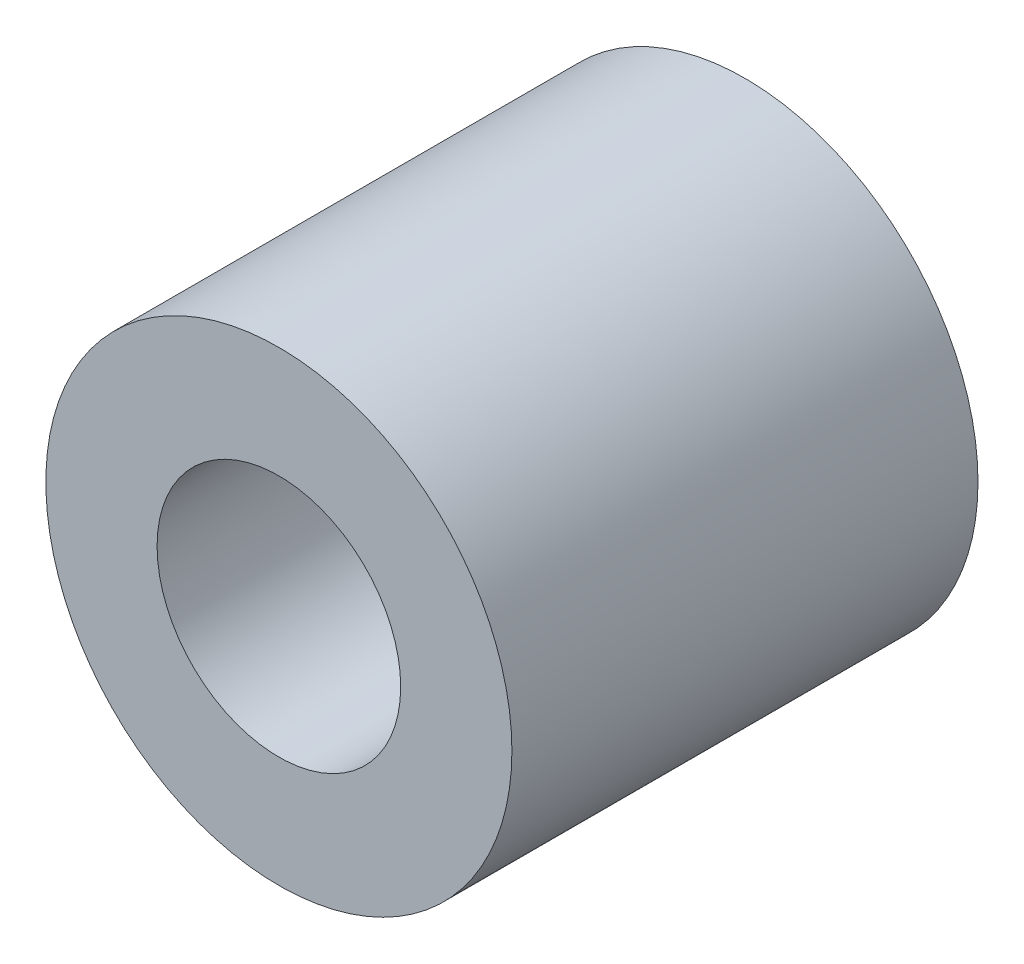
ISO-10303-21;
HEADER;
FILE_DESCRIPTION(('STEP AP214'),'2;1');
FILE_NAME('part.step','',(''),(''),'','','');
FILE_SCHEMA(('AUTOMOTIVE_DESIGN { 1 0 10303 214 1 1 1 1 }'));
ENDSEC;
DATA;
#1=APPLICATION_CONTEXT('core data for automotive mechanical design processes');
#2=APPLICATION_PROTOCOL_DEFINITION('international standard','automotive_design',2000,#1);
#3=PRODUCT_CONTEXT('',#1,'mechanical');
#4=PRODUCT('Part','Part','',(#3));
#5=PRODUCT_RELATED_PRODUCT_CATEGORY('part','',(#4));
#6=PRODUCT_DEFINITION_FORMATION('','',#4);
#7=PRODUCT_DEFINITION_CONTEXT('part definition',#1,'design');
#8=PRODUCT_DEFINITION('design','',#6,#7);
#9=PRODUCT_DEFINITION_SHAPE('','',#8);
#10=(LENGTH_UNIT() NAMED_UNIT(*) SI_UNIT(.MILLI.,.METRE.));
#11=(NAMED_UNIT(*) PLANE_ANGLE_UNIT() SI_UNIT($,.RADIAN.));
#12=(NAMED_UNIT(*) SI_UNIT($,.STERADIAN.) SOLID_ANGLE_UNIT());
#13=UNCERTAINTY_MEASURE_WITH_UNIT(LENGTH_MEASURE(1.E-05),#10,'distance_accuracy_value','');
#14=(GEOMETRIC_REPRESENTATION_CONTEXT(3) GLOBAL_UNCERTAINTY_ASSIGNED_CONTEXT((#13)) GLOBAL_UNIT_ASSIGNED_CONTEXT((#10,
#11,#12)) REPRESENTATION_CONTEXT('',''));
#15=CARTESIAN_POINT('',(0.,0.,0.));
#16=DIRECTION('',(0.,0.,1.));
#17=DIRECTION('',(1.,0.,0.));
#18=AXIS2_PLACEMENT_3D('',#15,#16,#17);
#19=CARTESIAN_POINT('',(0.,0.,9.525));
#20=DIRECTION('',(0.,0.,1.));
#21=DIRECTION('',(1.,0.,0.));
#22=AXIS2_PLACEMENT_3D('',#19,#20,#21);
#23=PLANE('',#22);
#24=CARTESIAN_POINT('',(0.,0.,9.525));
#25=DIRECTION('',(0.,0.,1.));
#26=DIRECTION('',(1.,0.,0.));
#27=AXIS2_PLACEMENT_3D('',#24,#25,#26);
#28=CIRCLE('',#27,4.7625);
#29=CARTESIAN_POINT('',(4.7625,0.,9.525));
#30=VERTEX_POINT('',#29);
#31=EDGE_CURVE('E10',#30,#30,#28,.T.);
#32=ORIENTED_EDGE('',*,*,#31,.T.);
#33=EDGE_LOOP('',(#32));
#34=FACE_BOUND('',#33,.T.);
#35=CARTESIAN_POINT('',(0.,0.,9.525));
#36=DIRECTION('',(0.,0.,1.));
#37=DIRECTION('',(1.,0.,0.));
#38=AXIS2_PLACEMENT_3D('',#35,#36,#37);
#39=CIRCLE('',#38,2.4892);
#40=CARTESIAN_POINT('',(2.4892,0.,9.525));
#41=VERTEX_POINT('',#40);
#42=EDGE_CURVE('E45',#41,#41,#39,.T.);
#43=ORIENTED_EDGE('',*,*,#42,.F.);
#44=EDGE_LOOP('',(#43));
#45=FACE_BOUND('',#44,.T.);
#46=ADVANCED_FACE('F34',(#34,#45),#23,.T.);
#47=CARTESIAN_POINT('',(0.,0.,0.));
#48=DIRECTION('',(0.,0.,1.));
#49=DIRECTION('',(1.,0.,0.));
#50=AXIS2_PLACEMENT_3D('',#47,#48,#49);
#51=PLANE('',#50);
#52=CARTESIAN_POINT('',(0.,0.,0.));
#53=DIRECTION('',(0.,0.,1.));
#54=DIRECTION('',(1.,0.,0.));
#55=AXIS2_PLACEMENT_3D('',#52,#53,#54);
#56=CIRCLE('',#55,4.7625);
#57=CARTESIAN_POINT('',(4.7625,0.,0.));
#58=VERTEX_POINT('',#57);
#59=EDGE_CURVE('E38',#58,#58,#56,.T.);
#60=ORIENTED_EDGE('',*,*,#59,.F.);
#61=EDGE_LOOP('',(#60));
#62=FACE_BOUND('',#61,.T.);
#63=CARTESIAN_POINT('',(0.,0.,0.));
#64=DIRECTION('',(0.,0.,1.));
#65=DIRECTION('',(1.,0.,0.));
#66=AXIS2_PLACEMENT_3D('',#63,#64,#65);
#67=CIRCLE('',#66,2.4892);
#68=CARTESIAN_POINT('',(2.4892,0.,0.));
#69=VERTEX_POINT('',#68);
#70=EDGE_CURVE('E47',#69,#69,#67,.T.);
#71=ORIENTED_EDGE('',*,*,#70,.T.);
#72=EDGE_LOOP('',(#71));
#73=FACE_BOUND('',#72,.T.);
#74=ADVANCED_FACE('F57',(#62,#73),#51,.F.);
#75=CARTESIAN_POINT('',(0.,0.,9.525));
#76=DIRECTION('',(0.,0.,-1.));
#77=DIRECTION('',(-1.,0.,0.));
#78=AXIS2_PLACEMENT_3D('',#75,#76,#77);
#79=CYLINDRICAL_SURFACE('',#78,4.7625);
#80=ORIENTED_EDGE('',*,*,#31,.F.);
#81=EDGE_LOOP('',(#80));
#82=FACE_BOUND('',#81,.T.);
#83=ORIENTED_EDGE('',*,*,#59,.T.);
#84=EDGE_LOOP('',(#83));
#85=FACE_BOUND('',#84,.T.);
#86=ADVANCED_FACE('F36',(#82,#85),#79,.T.);
#87=CARTESIAN_POINT('',(0.,0.,9.525));
#88=DIRECTION('',(0.,0.,-1.));
#89=DIRECTION('',(-1.,0.,0.));
#90=AXIS2_PLACEMENT_3D('',#87,#88,#89);
#91=CYLINDRICAL_SURFACE('',#90,2.4892);
#92=ORIENTED_EDGE('',*,*,#42,.T.);
#93=EDGE_LOOP('',(#92));
#94=FACE_BOUND('',#93,.T.);
#95=ORIENTED_EDGE('',*,*,#70,.F.);
#96=EDGE_LOOP('',(#95));
#97=FACE_BOUND('',#96,.T.);
#98=ADVANCED_FACE('F53',(#94,#97),#91,.F.);
#99=CLOSED_SHELL('',(#46,#74,#86,#98));
#100=MANIFOLD_SOLID_BREP('B2',#99);
#101=ADVANCED_BREP_SHAPE_REPRESENTATION('',(#18,#100),#14);
#102=SHAPE_DEFINITION_REPRESENTATION(#9,#101);
ENDSEC;
END-ISO-10303-21;
